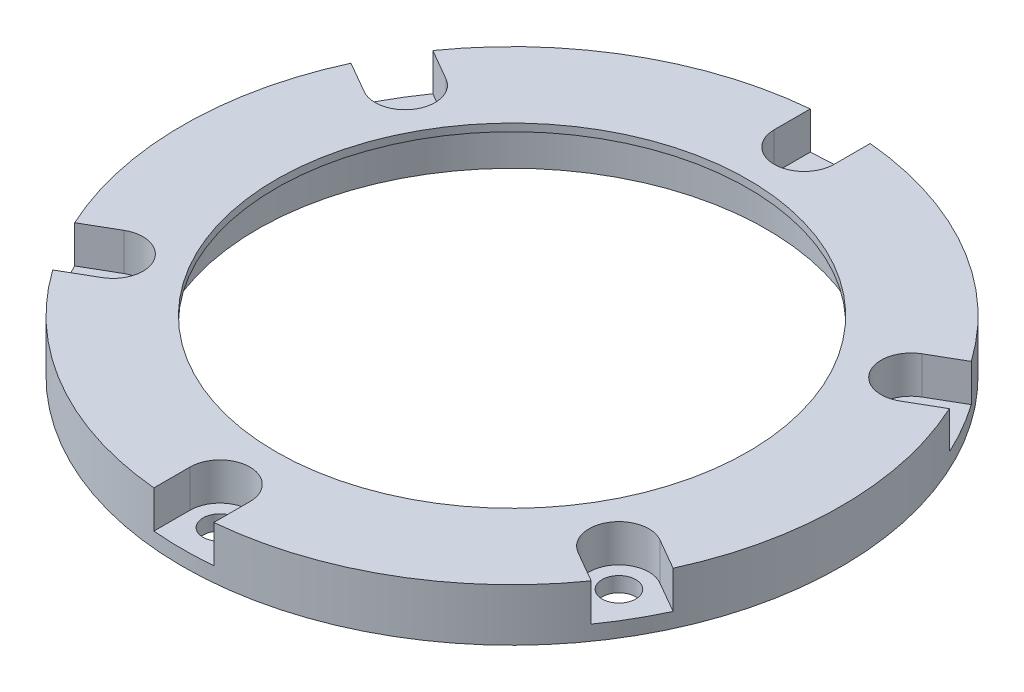
ISO-10303-21;
HEADER;
FILE_DESCRIPTION(('STEP AP214'),'2;1');
FILE_NAME('part.step','',(''),(''),'','','');
FILE_SCHEMA(('AUTOMOTIVE_DESIGN { 1 0 10303 214 1 1 1 1 }'));
ENDSEC;
DATA;
#1=APPLICATION_CONTEXT('core data for automotive mechanical design processes');
#2=APPLICATION_PROTOCOL_DEFINITION('international standard','automotive_design',2000,#1);
#3=PRODUCT_CONTEXT('',#1,'mechanical');
#4=PRODUCT('Part','Part','',(#3));
#5=PRODUCT_RELATED_PRODUCT_CATEGORY('part','',(#4));
#6=PRODUCT_DEFINITION_FORMATION('','',#4);
#7=PRODUCT_DEFINITION_CONTEXT('part definition',#1,'design');
#8=PRODUCT_DEFINITION('design','',#6,#7);
#9=PRODUCT_DEFINITION_SHAPE('','',#8);
#10=(LENGTH_UNIT() NAMED_UNIT(*) SI_UNIT(.MILLI.,.METRE.));
#11=(NAMED_UNIT(*) PLANE_ANGLE_UNIT() SI_UNIT($,.RADIAN.));
#12=(NAMED_UNIT(*) SI_UNIT($,.STERADIAN.) SOLID_ANGLE_UNIT());
#13=UNCERTAINTY_MEASURE_WITH_UNIT(LENGTH_MEASURE(1.E-05),#10,'distance_accuracy_value','');
#14=(GEOMETRIC_REPRESENTATION_CONTEXT(3) GLOBAL_UNCERTAINTY_ASSIGNED_CONTEXT((#13)) GLOBAL_UNIT_ASSIGNED_CONTEXT((#10,
#11,#12)) REPRESENTATION_CONTEXT('',''));
#15=CARTESIAN_POINT('',(0.,0.,0.));
#16=DIRECTION('',(0.,0.,1.));
#17=DIRECTION('',(1.,0.,0.));
#18=AXIS2_PLACEMENT_3D('',#15,#16,#17);
#19=CARTESIAN_POINT('',(-33.7749907475932,7.,-19.4999999999999));
#20=DIRECTION('',(0.,1.,0.));
#21=DIRECTION('',(0.,0.,1.));
#22=AXIS2_PLACEMENT_3D('',#19,#20,#21);
#23=CYLINDRICAL_SURFACE('',#22,4.);
#24=DIRECTION('',(0.,1.,0.));
#25=VECTOR('',#24,1.);
#26=CARTESIAN_POINT('',(-35.7749907475931,2.,-16.0358983848622));
#27=LINE('',#26,#25);
#28=CARTESIAN_POINT('',(-35.7749907475931,2.,-16.0358983848622));
#29=VERTEX_POINT('',#28);
#30=CARTESIAN_POINT('',(-35.7749907475931,7.,-16.0358983848622));
#31=VERTEX_POINT('',#30);
#32=EDGE_CURVE('E50',#29,#31,#27,.T.);
#33=ORIENTED_EDGE('',*,*,#32,.T.);
#34=CARTESIAN_POINT('',(-33.7749907475932,7.,-19.4999999999999));
#35=DIRECTION('',(0.,1.,0.));
#36=DIRECTION('',(0.,0.,1.));
#37=AXIS2_PLACEMENT_3D('',#34,#35,#36);
#38=CIRCLE('',#37,4.);
#39=CARTESIAN_POINT('',(-31.7749907475932,7.,-22.9641016151377));
#40=VERTEX_POINT('',#39);
#41=EDGE_CURVE('E230',#31,#40,#38,.T.);
#42=ORIENTED_EDGE('',*,*,#41,.T.);
#43=DIRECTION('',(0.,1.,0.));
#44=VECTOR('',#43,1.);
#45=CARTESIAN_POINT('',(-31.7749907475932,2.,-22.9641016151377));
#46=LINE('',#45,#44);
#47=CARTESIAN_POINT('',(-31.7749907475932,2.,-22.9641016151377));
#48=VERTEX_POINT('',#47);
#49=EDGE_CURVE('E503',#48,#40,#46,.T.);
#50=ORIENTED_EDGE('',*,*,#49,.F.);
#51=CARTESIAN_POINT('',(-33.7749907475932,2.,-19.4999999999999));
#52=DIRECTION('',(0.,1.,0.));
#53=DIRECTION('',(0.,0.,1.));
#54=AXIS2_PLACEMENT_3D('',#51,#52,#53);
#55=CIRCLE('',#54,4.);
#56=EDGE_CURVE('E233',#29,#48,#55,.T.);
#57=ORIENTED_EDGE('',*,*,#56,.F.);
#58=EDGE_LOOP('',(#33,#42,#50,#57));
#59=FACE_BOUND('',#58,.T.);
#60=ADVANCED_FACE('F35',(#59),#23,.F.);
#61=CARTESIAN_POINT('',(-33.774990747593,7.,19.5000000000002));
#62=DIRECTION('',(0.,1.,0.));
#63=DIRECTION('',(0.,0.,1.));
#64=AXIS2_PLACEMENT_3D('',#61,#62,#63);
#65=CYLINDRICAL_SURFACE('',#64,4.);
#66=DIRECTION('',(0.,1.,0.));
#67=VECTOR('',#66,1.);
#68=CARTESIAN_POINT('',(-31.774990747593,2.,22.9641016151379));
#69=LINE('',#68,#67);
#70=CARTESIAN_POINT('',(-31.774990747593,2.,22.9641016151379));
#71=VERTEX_POINT('',#70);
#72=CARTESIAN_POINT('',(-31.774990747593,7.,22.9641016151379));
#73=VERTEX_POINT('',#72);
#74=EDGE_CURVE('E58',#71,#73,#69,.T.);
#75=ORIENTED_EDGE('',*,*,#74,.T.);
#76=CARTESIAN_POINT('',(-33.774990747593,7.,19.5000000000002));
#77=DIRECTION('',(0.,1.,0.));
#78=DIRECTION('',(0.,0.,1.));
#79=AXIS2_PLACEMENT_3D('',#76,#77,#78);
#80=CIRCLE('',#79,4.);
#81=CARTESIAN_POINT('',(-35.774990747593,7.,16.0358983848624));
#82=VERTEX_POINT('',#81);
#83=EDGE_CURVE('E216',#73,#82,#80,.T.);
#84=ORIENTED_EDGE('',*,*,#83,.T.);
#85=DIRECTION('',(0.,1.,0.));
#86=VECTOR('',#85,1.);
#87=CARTESIAN_POINT('',(-35.774990747593,2.,16.0358983848624));
#88=LINE('',#87,#86);
#89=CARTESIAN_POINT('',(-35.774990747593,2.,16.0358983848624));
#90=VERTEX_POINT('',#89);
#91=EDGE_CURVE('E200',#90,#82,#88,.T.);
#92=ORIENTED_EDGE('',*,*,#91,.F.);
#93=CARTESIAN_POINT('',(-33.774990747593,2.,19.5000000000002));
#94=DIRECTION('',(0.,1.,0.));
#95=DIRECTION('',(0.,0.,1.));
#96=AXIS2_PLACEMENT_3D('',#93,#94,#95);
#97=CIRCLE('',#96,4.);
#98=EDGE_CURVE('E214',#71,#90,#97,.T.);
#99=ORIENTED_EDGE('',*,*,#98,.F.);
#100=EDGE_LOOP('',(#75,#84,#92,#99));
#101=FACE_BOUND('',#100,.T.);
#102=ADVANCED_FACE('F213',(#101),#65,.F.);
#103=CARTESIAN_POINT('',(0.,7.,39.));
#104=DIRECTION('',(0.,1.,0.));
#105=DIRECTION('',(0.,0.,1.));
#106=AXIS2_PLACEMENT_3D('',#103,#104,#105);
#107=CYLINDRICAL_SURFACE('',#106,4.);
#108=DIRECTION('',(0.,1.,0.));
#109=VECTOR('',#108,1.);
#110=CARTESIAN_POINT('',(4.,2.,39.));
#111=LINE('',#110,#109);
#112=CARTESIAN_POINT('',(4.,2.,39.));
#113=VERTEX_POINT('',#112);
#114=CARTESIAN_POINT('',(4.,7.,39.));
#115=VERTEX_POINT('',#114);
#116=EDGE_CURVE('E208',#113,#115,#111,.T.);
#117=ORIENTED_EDGE('',*,*,#116,.T.);
#118=CARTESIAN_POINT('',(0.,7.,39.));
#119=DIRECTION('',(0.,1.,0.));
#120=DIRECTION('',(0.,0.,1.));
#121=AXIS2_PLACEMENT_3D('',#118,#119,#120);
#122=CIRCLE('',#121,4.);
#123=CARTESIAN_POINT('',(-4.,7.,39.));
#124=VERTEX_POINT('',#123);
#125=EDGE_CURVE('E437',#115,#124,#122,.T.);
#126=ORIENTED_EDGE('',*,*,#125,.T.);
#127=DIRECTION('',(0.,1.,0.));
#128=VECTOR('',#127,1.);
#129=CARTESIAN_POINT('',(-4.,2.,39.));
#130=LINE('',#129,#128);
#131=CARTESIAN_POINT('',(-4.,2.,39.));
#132=VERTEX_POINT('',#131);
#133=EDGE_CURVE('E471',#132,#124,#130,.T.);
#134=ORIENTED_EDGE('',*,*,#133,.F.);
#135=CARTESIAN_POINT('',(0.,2.,39.));
#136=DIRECTION('',(0.,1.,0.));
#137=DIRECTION('',(0.,0.,1.));
#138=AXIS2_PLACEMENT_3D('',#135,#136,#137);
#139=CIRCLE('',#138,4.);
#140=EDGE_CURVE('E440',#113,#132,#139,.T.);
#141=ORIENTED_EDGE('',*,*,#140,.F.);
#142=EDGE_LOOP('',(#117,#126,#134,#141));
#143=FACE_BOUND('',#142,.T.);
#144=ADVANCED_FACE('F291',(#143),#107,.F.);
#145=CARTESIAN_POINT('',(33.7749907475933,7.,19.4999999999997));
#146=DIRECTION('',(0.,1.,0.));
#147=DIRECTION('',(0.,0.,1.));
#148=AXIS2_PLACEMENT_3D('',#145,#146,#147);
#149=CYLINDRICAL_SURFACE('',#148,4.);
#150=DIRECTION('',(0.,1.,0.));
#151=VECTOR('',#150,1.);
#152=CARTESIAN_POINT('',(35.7749907475933,2.,16.0358983848619));
#153=LINE('',#152,#151);
#154=CARTESIAN_POINT('',(35.7749907475933,2.,16.0358983848619));
#155=VERTEX_POINT('',#154);
#156=CARTESIAN_POINT('',(35.7749907475933,7.,16.0358983848619));
#157=VERTEX_POINT('',#156);
#158=EDGE_CURVE('E485',#155,#157,#153,.T.);
#159=ORIENTED_EDGE('',*,*,#158,.T.);
#160=CARTESIAN_POINT('',(33.7749907475933,7.,19.4999999999997));
#161=DIRECTION('',(0.,1.,0.));
#162=DIRECTION('',(0.,0.,1.));
#163=AXIS2_PLACEMENT_3D('',#160,#161,#162);
#164=CIRCLE('',#163,4.);
#165=CARTESIAN_POINT('',(31.7749907475933,7.,22.9641016151375));
#166=VERTEX_POINT('',#165);
#167=EDGE_CURVE('E425',#157,#166,#164,.T.);
#168=ORIENTED_EDGE('',*,*,#167,.T.);
#169=DIRECTION('',(0.,1.,0.));
#170=VECTOR('',#169,1.);
#171=CARTESIAN_POINT('',(31.7749907475933,2.,22.9641016151375));
#172=LINE('',#171,#170);
#173=CARTESIAN_POINT('',(31.7749907475933,2.,22.9641016151375));
#174=VERTEX_POINT('',#173);
#175=EDGE_CURVE('E484',#174,#166,#172,.T.);
#176=ORIENTED_EDGE('',*,*,#175,.F.);
#177=CARTESIAN_POINT('',(33.7749907475933,2.,19.4999999999997));
#178=DIRECTION('',(0.,1.,0.));
#179=DIRECTION('',(0.,0.,1.));
#180=AXIS2_PLACEMENT_3D('',#177,#178,#179);
#181=CIRCLE('',#180,4.);
#182=EDGE_CURVE('E428',#155,#174,#181,.T.);
#183=ORIENTED_EDGE('',*,*,#182,.F.);
#184=EDGE_LOOP('',(#159,#168,#176,#183));
#185=FACE_BOUND('',#184,.T.);
#186=ADVANCED_FACE('F550',(#185),#149,.F.);
#187=CARTESIAN_POINT('',(33.7749907475929,7.,-19.5000000000004));
#188=DIRECTION('',(0.,1.,0.));
#189=DIRECTION('',(0.,0.,1.));
#190=AXIS2_PLACEMENT_3D('',#187,#188,#189);
#191=CYLINDRICAL_SURFACE('',#190,4.);
#192=DIRECTION('',(0.,1.,0.));
#193=VECTOR('',#192,1.);
#194=CARTESIAN_POINT('',(31.7749907475928,2.,-22.9641016151381));
#195=LINE('',#194,#193);
#196=CARTESIAN_POINT('',(31.7749907475928,2.,-22.9641016151381));
#197=VERTEX_POINT('',#196);
#198=CARTESIAN_POINT('',(31.7749907475928,7.,-22.9641016151381));
#199=VERTEX_POINT('',#198);
#200=EDGE_CURVE('E481',#197,#199,#195,.T.);
#201=ORIENTED_EDGE('',*,*,#200,.T.);
#202=CARTESIAN_POINT('',(33.7749907475929,7.,-19.5000000000004));
#203=DIRECTION('',(0.,1.,0.));
#204=DIRECTION('',(0.,0.,1.));
#205=AXIS2_PLACEMENT_3D('',#202,#203,#204);
#206=CIRCLE('',#205,4.);
#207=CARTESIAN_POINT('',(35.7749907475929,7.,-16.0358983848627));
#208=VERTEX_POINT('',#207);
#209=EDGE_CURVE('E340',#199,#208,#206,.T.);
#210=ORIENTED_EDGE('',*,*,#209,.T.);
#211=DIRECTION('',(0.,1.,0.));
#212=VECTOR('',#211,1.);
#213=CARTESIAN_POINT('',(35.7749907475929,2.,-16.0358983848627));
#214=LINE('',#213,#212);
#215=CARTESIAN_POINT('',(35.7749907475929,2.,-16.0358983848627));
#216=VERTEX_POINT('',#215);
#217=EDGE_CURVE('E495',#216,#208,#214,.T.);
#218=ORIENTED_EDGE('',*,*,#217,.F.);
#219=CARTESIAN_POINT('',(33.7749907475929,2.,-19.5000000000004));
#220=DIRECTION('',(0.,1.,0.));
#221=DIRECTION('',(0.,0.,1.));
#222=AXIS2_PLACEMENT_3D('',#219,#220,#221);
#223=CIRCLE('',#222,4.);
#224=EDGE_CURVE('E416',#197,#216,#223,.T.);
#225=ORIENTED_EDGE('',*,*,#224,.F.);
#226=EDGE_LOOP('',(#201,#210,#218,#225));
#227=FACE_BOUND('',#226,.T.);
#228=ADVANCED_FACE('F309',(#227),#191,.F.);
#229=CARTESIAN_POINT('',(0.,7.,-39.));
#230=DIRECTION('',(0.,1.,0.));
#231=DIRECTION('',(0.,0.,1.));
#232=AXIS2_PLACEMENT_3D('',#229,#230,#231);
#233=CYLINDRICAL_SURFACE('',#232,4.);
#234=DIRECTION('',(0.,1.,0.));
#235=VECTOR('',#234,1.);
#236=CARTESIAN_POINT('',(-4.,2.,-39.));
#237=LINE('',#236,#235);
#238=CARTESIAN_POINT('',(-4.,2.,-39.));
#239=VERTEX_POINT('',#238);
#240=CARTESIAN_POINT('',(-4.,7.,-39.));
#241=VERTEX_POINT('',#240);
#242=EDGE_CURVE('E401',#239,#241,#237,.T.);
#243=ORIENTED_EDGE('',*,*,#242,.T.);
#244=CARTESIAN_POINT('',(0.,7.,-39.));
#245=DIRECTION('',(0.,1.,0.));
#246=DIRECTION('',(0.,0.,1.));
#247=AXIS2_PLACEMENT_3D('',#244,#245,#246);
#248=CIRCLE('',#247,4.);
#249=CARTESIAN_POINT('',(4.,7.,-39.));
#250=VERTEX_POINT('',#249);
#251=EDGE_CURVE('E242',#241,#250,#248,.T.);
#252=ORIENTED_EDGE('',*,*,#251,.T.);
#253=DIRECTION('',(0.,1.,0.));
#254=VECTOR('',#253,1.);
#255=CARTESIAN_POINT('',(4.,2.,-39.));
#256=LINE('',#255,#254);
#257=CARTESIAN_POINT('',(4.,2.,-39.));
#258=VERTEX_POINT('',#257);
#259=EDGE_CURVE('E400',#258,#250,#256,.T.);
#260=ORIENTED_EDGE('',*,*,#259,.F.);
#261=CARTESIAN_POINT('',(0.,2.,-39.));
#262=DIRECTION('',(0.,1.,0.));
#263=DIRECTION('',(0.,0.,1.));
#264=AXIS2_PLACEMENT_3D('',#261,#262,#263);
#265=CIRCLE('',#264,4.);
#266=EDGE_CURVE('E245',#239,#258,#265,.T.);
#267=ORIENTED_EDGE('',*,*,#266,.F.);
#268=EDGE_LOOP('',(#243,#252,#260,#267));
#269=FACE_BOUND('',#268,.T.);
#270=ADVANCED_FACE('F306',(#269),#233,.F.);
#271=CARTESIAN_POINT('',(0.,0.,0.));
#272=DIRECTION('',(0.,1.,0.));
#273=DIRECTION('',(0.,0.,1.));
#274=AXIS2_PLACEMENT_3D('',#271,#272,#273);
#275=PLANE('',#274);
#276=CARTESIAN_POINT('',(33.7749907475929,0.,-19.5000000000004));
#277=DIRECTION('',(0.,1.,0.));
#278=DIRECTION('',(0.,0.,1.));
#279=AXIS2_PLACEMENT_3D('',#276,#277,#278);
#280=CIRCLE('',#279,2.25);
#281=CARTESIAN_POINT('',(33.7749907475929,0.,-17.2500000000004));
#282=VERTEX_POINT('',#281);
#283=EDGE_CURVE('E422',#282,#282,#280,.T.);
#284=ORIENTED_EDGE('',*,*,#283,.T.);
#285=EDGE_LOOP('',(#284));
#286=FACE_BOUND('',#285,.T.);
#287=CARTESIAN_POINT('',(33.7749907475933,0.,19.4999999999997));
#288=DIRECTION('',(0.,1.,0.));
#289=DIRECTION('',(0.,0.,1.));
#290=AXIS2_PLACEMENT_3D('',#287,#288,#289);
#291=CIRCLE('',#290,2.25);
#292=CARTESIAN_POINT('',(33.7749907475933,0.,21.7499999999997));
#293=VERTEX_POINT('',#292);
#294=EDGE_CURVE('E434',#293,#293,#291,.T.);
#295=ORIENTED_EDGE('',*,*,#294,.T.);
#296=EDGE_LOOP('',(#295));
#297=FACE_BOUND('',#296,.T.);
#298=CARTESIAN_POINT('',(0.,0.,39.));
#299=DIRECTION('',(0.,1.,0.));
#300=DIRECTION('',(0.,0.,1.));
#301=AXIS2_PLACEMENT_3D('',#298,#299,#300);
#302=CIRCLE('',#301,2.25);
#303=CARTESIAN_POINT('',(0.,0.,41.25));
#304=VERTEX_POINT('',#303);
#305=EDGE_CURVE('E224',#304,#304,#302,.T.);
#306=ORIENTED_EDGE('',*,*,#305,.T.);
#307=EDGE_LOOP('',(#306));
#308=FACE_BOUND('',#307,.T.);
#309=CARTESIAN_POINT('',(-33.774990747593,0.,19.5000000000002));
#310=DIRECTION('',(0.,1.,0.));
#311=DIRECTION('',(0.,0.,1.));
#312=AXIS2_PLACEMENT_3D('',#309,#310,#311);
#313=CIRCLE('',#312,2.25);
#314=CARTESIAN_POINT('',(-33.774990747593,0.,21.7500000000002));
#315=VERTEX_POINT('',#314);
#316=EDGE_CURVE('E222',#315,#315,#313,.T.);
#317=ORIENTED_EDGE('',*,*,#316,.T.);
#318=EDGE_LOOP('',(#317));
#319=FACE_BOUND('',#318,.T.);
#320=CARTESIAN_POINT('',(-33.7749907475932,0.,-19.4999999999999));
#321=DIRECTION('',(0.,1.,0.));
#322=DIRECTION('',(0.,0.,1.));
#323=AXIS2_PLACEMENT_3D('',#320,#321,#322);
#324=CIRCLE('',#323,2.25);
#325=CARTESIAN_POINT('',(-33.7749907475932,0.,-17.2499999999999));
#326=VERTEX_POINT('',#325);
#327=EDGE_CURVE('E239',#326,#326,#324,.T.);
#328=ORIENTED_EDGE('',*,*,#327,.T.);
#329=EDGE_LOOP('',(#328));
#330=FACE_BOUND('',#329,.T.);
#331=CARTESIAN_POINT('',(0.,0.,-39.));
#332=DIRECTION('',(0.,1.,0.));
#333=DIRECTION('',(0.,0.,1.));
#334=AXIS2_PLACEMENT_3D('',#331,#332,#333);
#335=CIRCLE('',#334,2.25);
#336=CARTESIAN_POINT('',(0.,0.,-36.75));
#337=VERTEX_POINT('',#336);
#338=EDGE_CURVE('E251',#337,#337,#335,.T.);
#339=ORIENTED_EDGE('',*,*,#338,.T.);
#340=EDGE_LOOP('',(#339));
#341=FACE_BOUND('',#340,.T.);
#342=CARTESIAN_POINT('',(0.,0.,0.));
#343=DIRECTION('',(0.,1.,0.));
#344=DIRECTION('',(0.,0.,1.));
#345=AXIS2_PLACEMENT_3D('',#342,#343,#344);
#346=CIRCLE('',#345,44.);
#347=CARTESIAN_POINT('',(0.,0.,44.));
#348=VERTEX_POINT('',#347);
#349=EDGE_CURVE('E11',#348,#348,#346,.T.);
#350=ORIENTED_EDGE('',*,*,#349,.F.);
#351=EDGE_LOOP('',(#350));
#352=FACE_BOUND('',#351,.T.);
#353=CARTESIAN_POINT('',(0.,0.,0.));
#354=DIRECTION('',(0.,1.,0.));
#355=DIRECTION('',(0.,0.,1.));
#356=AXIS2_PLACEMENT_3D('',#353,#354,#355);
#357=CIRCLE('',#356,34.);
#358=CARTESIAN_POINT('',(0.,0.,34.));
#359=VERTEX_POINT('',#358);
#360=EDGE_CURVE('E43',#359,#359,#357,.T.);
#361=ORIENTED_EDGE('',*,*,#360,.T.);
#362=EDGE_LOOP('',(#361));
#363=FACE_BOUND('',#362,.T.);
#364=ADVANCED_FACE('F270',(#286,#297,#308,#319,#330,#341,#352,#363),#275,.F.);
#365=CARTESIAN_POINT('',(0.,6.,0.));
#366=DIRECTION('',(0.,-1.,0.));
#367=DIRECTION('',(0.,0.,-1.));
#368=AXIS2_PLACEMENT_3D('',#365,#366,#367);
#369=CYLINDRICAL_SURFACE('',#368,44.);
#370=CARTESIAN_POINT('',(0.,7.,0.));
#371=DIRECTION('',(0.,1.,0.));
#372=DIRECTION('',(0.,0.,1.));
#373=AXIS2_PLACEMENT_3D('',#370,#371,#372);
#374=CIRCLE('',#373,44.);
#375=CARTESIAN_POINT('',(35.9473319220203,7.,-25.3730039153448));
#376=VERTEX_POINT('',#375);
#377=CARTESIAN_POINT('',(4.,7.,-43.8178046004133));
#378=VERTEX_POINT('',#377);
#379=EDGE_CURVE('E258',#376,#378,#374,.T.);
#380=ORIENTED_EDGE('',*,*,#379,.F.);
#381=DIRECTION('',(0.,-1.,0.));
#382=VECTOR('',#381,1.);
#383=CARTESIAN_POINT('',(35.9473319220203,6.,-25.3730039153448));
#384=LINE('',#383,#382);
#385=CARTESIAN_POINT('',(35.9473319220203,2.,-25.3730039153448));
#386=VERTEX_POINT('',#385);
#387=EDGE_CURVE('E343',#376,#386,#384,.T.);
#388=ORIENTED_EDGE('',*,*,#387,.T.);
#389=CARTESIAN_POINT('',(0.,2.,0.));
#390=DIRECTION('',(0.,1.,0.));
#391=DIRECTION('',(0.,0.,1.));
#392=AXIS2_PLACEMENT_3D('',#389,#390,#391);
#393=CIRCLE('',#392,44.);
#394=CARTESIAN_POINT('',(39.9473319220203,2.,-18.4448006850694));
#395=VERTEX_POINT('',#394);
#396=EDGE_CURVE('E505',#395,#386,#393,.T.);
#397=ORIENTED_EDGE('',*,*,#396,.F.);
#398=DIRECTION('',(0.,-1.,0.));
#399=VECTOR('',#398,1.);
#400=CARTESIAN_POINT('',(39.9473319220203,6.,-18.4448006850694));
#401=LINE('',#400,#399);
#402=CARTESIAN_POINT('',(39.9473319220203,7.,-18.4448006850694));
#403=VERTEX_POINT('',#402);
#404=EDGE_CURVE('E344',#395,#403,#401,.F.);
#405=ORIENTED_EDGE('',*,*,#404,.T.);
#406=CARTESIAN_POINT('',(39.9473319220207,7.,18.4448006850685));
#407=VERTEX_POINT('',#406);
#408=EDGE_CURVE('E352',#407,#403,#374,.T.);
#409=ORIENTED_EDGE('',*,*,#408,.F.);
#410=DIRECTION('',(0.,-1.,0.));
#411=VECTOR('',#410,1.);
#412=CARTESIAN_POINT('',(39.9473319220207,6.,18.4448006850685));
#413=LINE('',#412,#411);
#414=CARTESIAN_POINT('',(39.9473319220207,2.,18.4448006850685));
#415=VERTEX_POINT('',#414);
#416=EDGE_CURVE('E522',#407,#415,#413,.T.);
#417=ORIENTED_EDGE('',*,*,#416,.T.);
#418=CARTESIAN_POINT('',(0.,2.,0.));
#419=DIRECTION('',(0.,1.,0.));
#420=DIRECTION('',(0.,0.,1.));
#421=AXIS2_PLACEMENT_3D('',#418,#419,#420);
#422=CIRCLE('',#421,44.);
#423=CARTESIAN_POINT('',(35.9473319220208,2.,25.3730039153441));
#424=VERTEX_POINT('',#423);
#425=EDGE_CURVE('E513',#424,#415,#422,.T.);
#426=ORIENTED_EDGE('',*,*,#425,.F.);
#427=DIRECTION('',(0.,-1.,0.));
#428=VECTOR('',#427,1.);
#429=CARTESIAN_POINT('',(35.9473319220208,6.,25.3730039153441));
#430=LINE('',#429,#428);
#431=CARTESIAN_POINT('',(35.9473319220208,7.,25.3730039153441));
#432=VERTEX_POINT('',#431);
#433=EDGE_CURVE('E517',#424,#432,#430,.F.);
#434=ORIENTED_EDGE('',*,*,#433,.T.);
#435=CARTESIAN_POINT('',(4.,7.,43.8178046004133));
#436=VERTEX_POINT('',#435);
#437=EDGE_CURVE('E354',#436,#432,#374,.T.);
#438=ORIENTED_EDGE('',*,*,#437,.F.);
#439=DIRECTION('',(0.,-1.,0.));
#440=VECTOR('',#439,1.);
#441=CARTESIAN_POINT('',(4.,6.,43.8178046004133));
#442=LINE('',#441,#440);
#443=CARTESIAN_POINT('',(4.,2.,43.8178046004133));
#444=VERTEX_POINT('',#443);
#445=EDGE_CURVE('E534',#436,#444,#442,.T.);
#446=ORIENTED_EDGE('',*,*,#445,.T.);
#447=CARTESIAN_POINT('',(0.,2.,0.));
#448=DIRECTION('',(0.,1.,0.));
#449=DIRECTION('',(0.,0.,1.));
#450=AXIS2_PLACEMENT_3D('',#447,#448,#449);
#451=CIRCLE('',#450,44.);
#452=CARTESIAN_POINT('',(-4.,2.,43.8178046004133));
#453=VERTEX_POINT('',#452);
#454=EDGE_CURVE('E525',#453,#444,#451,.T.);
#455=ORIENTED_EDGE('',*,*,#454,.F.);
#456=DIRECTION('',(0.,-1.,0.));
#457=VECTOR('',#456,1.);
#458=CARTESIAN_POINT('',(-4.,6.,43.8178046004133));
#459=LINE('',#458,#457);
#460=CARTESIAN_POINT('',(-4.,7.,43.8178046004133));
#461=VERTEX_POINT('',#460);
#462=EDGE_CURVE('E529',#453,#461,#459,.F.);
#463=ORIENTED_EDGE('',*,*,#462,.T.);
#464=CARTESIAN_POINT('',(-35.9473319220205,7.,25.3730039153446));
#465=VERTEX_POINT('',#464);
#466=EDGE_CURVE('E358',#465,#461,#374,.T.);
#467=ORIENTED_EDGE('',*,*,#466,.F.);
#468=DIRECTION('',(0.,-1.,0.));
#469=VECTOR('',#468,1.);
#470=CARTESIAN_POINT('',(-35.9473319220205,6.,25.3730039153446));
#471=LINE('',#470,#469);
#472=CARTESIAN_POINT('',(-35.9473319220205,2.,25.3730039153446));
#473=VERTEX_POINT('',#472);
#474=EDGE_CURVE('E379',#465,#473,#471,.T.);
#475=ORIENTED_EDGE('',*,*,#474,.T.);
#476=CARTESIAN_POINT('',(0.,2.,0.));
#477=DIRECTION('',(0.,1.,0.));
#478=DIRECTION('',(0.,0.,1.));
#479=AXIS2_PLACEMENT_3D('',#476,#477,#478);
#480=CIRCLE('',#479,44.);
#481=CARTESIAN_POINT('',(-39.9473319220205,2.,18.4448006850691));
#482=VERTEX_POINT('',#481);
#483=EDGE_CURVE('E376',#482,#473,#480,.T.);
#484=ORIENTED_EDGE('',*,*,#483,.F.);
#485=DIRECTION('',(0.,-1.,0.));
#486=VECTOR('',#485,1.);
#487=CARTESIAN_POINT('',(-39.9473319220205,6.,18.4448006850691));
#488=LINE('',#487,#486);
#489=CARTESIAN_POINT('',(-39.9473319220205,7.,18.4448006850691));
#490=VERTEX_POINT('',#489);
#491=EDGE_CURVE('E203',#482,#490,#488,.F.);
#492=ORIENTED_EDGE('',*,*,#491,.T.);
#493=CARTESIAN_POINT('',(-39.9473319220206,7.,-18.4448006850688));
#494=VERTEX_POINT('',#493);
#495=EDGE_CURVE('E265',#494,#490,#374,.T.);
#496=ORIENTED_EDGE('',*,*,#495,.F.);
#497=DIRECTION('',(0.,-1.,0.));
#498=VECTOR('',#497,1.);
#499=CARTESIAN_POINT('',(-39.9473319220206,6.,-18.4448006850688));
#500=LINE('',#499,#498);
#501=CARTESIAN_POINT('',(-39.9473319220206,2.,-18.4448006850688));
#502=VERTEX_POINT('',#501);
#503=EDGE_CURVE('E374',#494,#502,#500,.T.);
#504=ORIENTED_EDGE('',*,*,#503,.T.);
#505=CARTESIAN_POINT('',(0.,2.,0.));
#506=DIRECTION('',(0.,1.,0.));
#507=DIRECTION('',(0.,0.,1.));
#508=AXIS2_PLACEMENT_3D('',#505,#506,#507);
#509=CIRCLE('',#508,44.);
#510=CARTESIAN_POINT('',(-35.9473319220206,2.,-25.3730039153443));
#511=VERTEX_POINT('',#510);
#512=EDGE_CURVE('E385',#511,#502,#509,.T.);
#513=ORIENTED_EDGE('',*,*,#512,.F.);
#514=DIRECTION('',(0.,-1.,0.));
#515=VECTOR('',#514,1.);
#516=CARTESIAN_POINT('',(-35.9473319220206,6.,-25.3730039153443));
#517=LINE('',#516,#515);
#518=CARTESIAN_POINT('',(-35.9473319220206,7.,-25.3730039153443));
#519=VERTEX_POINT('',#518);
#520=EDGE_CURVE('E389',#511,#519,#517,.F.);
#521=ORIENTED_EDGE('',*,*,#520,.T.);
#522=CARTESIAN_POINT('',(-4.,7.,-43.8178046004133));
#523=VERTEX_POINT('',#522);
#524=EDGE_CURVE('E261',#523,#519,#374,.T.);
#525=ORIENTED_EDGE('',*,*,#524,.F.);
#526=DIRECTION('',(0.,-1.,0.));
#527=VECTOR('',#526,1.);
#528=CARTESIAN_POINT('',(-4.,6.,-43.8178046004133));
#529=LINE('',#528,#527);
#530=CARTESIAN_POINT('',(-4.,2.,-43.8178046004133));
#531=VERTEX_POINT('',#530);
#532=EDGE_CURVE('E412',#523,#531,#529,.T.);
#533=ORIENTED_EDGE('',*,*,#532,.T.);
#534=CARTESIAN_POINT('',(0.,2.,0.));
#535=DIRECTION('',(0.,1.,0.));
#536=DIRECTION('',(0.,0.,1.));
#537=AXIS2_PLACEMENT_3D('',#534,#535,#536);
#538=CIRCLE('',#537,44.);
#539=CARTESIAN_POINT('',(4.,2.,-43.8178046004133));
#540=VERTEX_POINT('',#539);
#541=EDGE_CURVE('E404',#540,#531,#538,.T.);
#542=ORIENTED_EDGE('',*,*,#541,.F.);
#543=DIRECTION('',(0.,-1.,0.));
#544=VECTOR('',#543,1.);
#545=CARTESIAN_POINT('',(4.,6.,-43.8178046004133));
#546=LINE('',#545,#544);
#547=EDGE_CURVE('E351',#540,#378,#546,.F.);
#548=ORIENTED_EDGE('',*,*,#547,.T.);
#549=EDGE_LOOP('',(#380,#388,#397,#405,#409,#417,#426,#434,#438,#446,#455,#463,#467,#475,#484,
#492,#496,#504,#513,#521,#525,#533,#542,#548));
#550=FACE_BOUND('',#549,.T.);
#551=ORIENTED_EDGE('',*,*,#349,.T.);
#552=EDGE_LOOP('',(#551));
#553=FACE_BOUND('',#552,.T.);
#554=ADVANCED_FACE('F37',(#550,#553),#369,.T.);
#555=CARTESIAN_POINT('',(0.,6.,0.));
#556=DIRECTION('',(0.,-1.,0.));
#557=DIRECTION('',(0.,0.,-1.));
#558=AXIS2_PLACEMENT_3D('',#555,#556,#557);
#559=CYLINDRICAL_SURFACE('',#558,34.);
#560=CARTESIAN_POINT('',(0.,6.,0.));
#561=DIRECTION('',(0.,1.,0.));
#562=DIRECTION('',(0.,0.,1.));
#563=AXIS2_PLACEMENT_3D('',#560,#561,#562);
#564=CIRCLE('',#563,34.);
#565=CARTESIAN_POINT('',(0.,6.,34.));
#566=VERTEX_POINT('',#565);
#567=EDGE_CURVE('E264',#566,#566,#564,.T.);
#568=ORIENTED_EDGE('',*,*,#567,.T.);
#569=EDGE_LOOP('',(#568));
#570=FACE_BOUND('',#569,.T.);
#571=ORIENTED_EDGE('',*,*,#360,.F.);
#572=EDGE_LOOP('',(#571));
#573=FACE_BOUND('',#572,.T.);
#574=ADVANCED_FACE('F272',(#570,#573),#559,.F.);
#575=CARTESIAN_POINT('',(0.,6.,0.));
#576=DIRECTION('',(0.,1.,0.));
#577=DIRECTION('',(0.,0.,1.));
#578=AXIS2_PLACEMENT_3D('',#575,#576,#577);
#579=PLANE('',#578);
#580=CARTESIAN_POINT('',(0.,6.,0.));
#581=DIRECTION('',(0.,1.,0.));
#582=DIRECTION('',(0.,0.,1.));
#583=AXIS2_PLACEMENT_3D('',#580,#581,#582);
#584=CIRCLE('',#583,31.5);
#585=CARTESIAN_POINT('',(0.,6.,31.5));
#586=VERTEX_POINT('',#585);
#587=EDGE_CURVE('E254',#586,#586,#584,.T.);
#588=ORIENTED_EDGE('',*,*,#587,.T.);
#589=EDGE_LOOP('',(#588));
#590=FACE_BOUND('',#589,.T.);
#591=ORIENTED_EDGE('',*,*,#567,.F.);
#592=EDGE_LOOP('',(#591));
#593=FACE_BOUND('',#592,.T.);
#594=ADVANCED_FACE('F274',(#590,#593),#579,.F.);
#595=CARTESIAN_POINT('',(0.,7.,0.));
#596=DIRECTION('',(0.,1.,0.));
#597=DIRECTION('',(0.,0.,1.));
#598=AXIS2_PLACEMENT_3D('',#595,#596,#597);
#599=PLANE('',#598);
#600=DIRECTION('',(-0.866025403784433,0.,0.50000000000001));
#601=VECTOR('',#600,1.);
#602=CARTESIAN_POINT('',(-2.00000000000004,7.,-3.46410161513773));
#603=LINE('',#602,#601);
#604=EDGE_CURVE('E329',#376,#199,#603,.T.);
#605=ORIENTED_EDGE('',*,*,#604,.F.);
#606=ORIENTED_EDGE('',*,*,#379,.T.);
#607=DIRECTION('',(0.,0.,-1.));
#608=VECTOR('',#607,1.);
#609=CARTESIAN_POINT('',(4.,7.,0.));
#610=LINE('',#609,#608);
#611=EDGE_CURVE('E407',#250,#378,#610,.T.);
#612=ORIENTED_EDGE('',*,*,#611,.F.);
#613=ORIENTED_EDGE('',*,*,#251,.F.);
#614=DIRECTION('',(0.,0.,1.));
#615=VECTOR('',#614,1.);
#616=CARTESIAN_POINT('',(-4.,7.,0.));
#617=LINE('',#616,#615);
#618=EDGE_CURVE('E410',#523,#241,#617,.T.);
#619=ORIENTED_EDGE('',*,*,#618,.F.);
#620=ORIENTED_EDGE('',*,*,#524,.T.);
#621=DIRECTION('',(-0.86602540378444,0.,-0.499999999999998));
#622=VECTOR('',#621,1.);
#623=CARTESIAN_POINT('',(1.99999999999999,7.,-3.46410161513775));
#624=LINE('',#623,#622);
#625=EDGE_CURVE('E387',#40,#519,#624,.T.);
#626=ORIENTED_EDGE('',*,*,#625,.F.);
#627=ORIENTED_EDGE('',*,*,#41,.F.);
#628=DIRECTION('',(0.86602540378444,0.,0.499999999999998));
#629=VECTOR('',#628,1.);
#630=CARTESIAN_POINT('',(-1.99999999999999,7.,3.46410161513775));
#631=LINE('',#630,#629);
#632=EDGE_CURVE('E371',#494,#31,#631,.T.);
#633=ORIENTED_EDGE('',*,*,#632,.F.);
#634=ORIENTED_EDGE('',*,*,#495,.T.);
#635=DIRECTION('',(-0.866025403784436,0.,0.500000000000004));
#636=VECTOR('',#635,1.);
#637=CARTESIAN_POINT('',(-2.00000000000001,7.,-3.46410161513774));
#638=LINE('',#637,#636);
#639=EDGE_CURVE('E369',#82,#490,#638,.T.);
#640=ORIENTED_EDGE('',*,*,#639,.F.);
#641=ORIENTED_EDGE('',*,*,#83,.F.);
#642=DIRECTION('',(0.866025403784436,0.,-0.500000000000004));
#643=VECTOR('',#642,1.);
#644=CARTESIAN_POINT('',(2.00000000000002,7.,3.46410161513775));
#645=LINE('',#644,#643);
#646=EDGE_CURVE('E377',#465,#73,#645,.T.);
#647=ORIENTED_EDGE('',*,*,#646,.F.);
#648=ORIENTED_EDGE('',*,*,#466,.T.);
#649=DIRECTION('',(0.,0.,1.));
#650=VECTOR('',#649,1.);
#651=CARTESIAN_POINT('',(-4.,7.,0.));
#652=LINE('',#651,#650);
#653=EDGE_CURVE('E527',#124,#461,#652,.T.);
#654=ORIENTED_EDGE('',*,*,#653,.F.);
#655=ORIENTED_EDGE('',*,*,#125,.F.);
#656=DIRECTION('',(0.,0.,-1.));
#657=VECTOR('',#656,1.);
#658=CARTESIAN_POINT('',(4.,7.,0.));
#659=LINE('',#658,#657);
#660=EDGE_CURVE('E532',#436,#115,#659,.T.);
#661=ORIENTED_EDGE('',*,*,#660,.F.);
#662=ORIENTED_EDGE('',*,*,#437,.T.);
#663=DIRECTION('',(0.866025403784443,0.,0.499999999999992));
#664=VECTOR('',#663,1.);
#665=CARTESIAN_POINT('',(-1.99999999999997,7.,3.46410161513777));
#666=LINE('',#665,#664);
#667=EDGE_CURVE('E515',#166,#432,#666,.T.);
#668=ORIENTED_EDGE('',*,*,#667,.F.);
#669=ORIENTED_EDGE('',*,*,#167,.F.);
#670=DIRECTION('',(-0.866025403784443,0.,-0.499999999999992));
#671=VECTOR('',#670,1.);
#672=CARTESIAN_POINT('',(1.99999999999996,7.,-3.46410161513776));
#673=LINE('',#672,#671);
#674=EDGE_CURVE('E520',#407,#157,#673,.T.);
#675=ORIENTED_EDGE('',*,*,#674,.F.);
#676=ORIENTED_EDGE('',*,*,#408,.T.);
#677=DIRECTION('',(0.866025403784433,0.,-0.50000000000001));
#678=VECTOR('',#677,1.);
#679=CARTESIAN_POINT('',(2.00000000000003,7.,3.46410161513772));
#680=LINE('',#679,#678);
#681=EDGE_CURVE('E508',#208,#403,#680,.T.);
#682=ORIENTED_EDGE('',*,*,#681,.F.);
#683=ORIENTED_EDGE('',*,*,#209,.F.);
#684=EDGE_LOOP('',(#605,#606,#612,#613,#619,#620,#626,#627,#633,#634,#640,#641,#647,#648,#654,
#655,#661,#662,#668,#669,#675,#676,#682,#683));
#685=FACE_BOUND('',#684,.T.);
#686=CARTESIAN_POINT('',(0.,7.,0.));
#687=DIRECTION('',(0.,1.,0.));
#688=DIRECTION('',(0.,0.,1.));
#689=AXIS2_PLACEMENT_3D('',#686,#687,#688);
#690=CIRCLE('',#689,31.5);
#691=CARTESIAN_POINT('',(0.,7.,31.5));
#692=VERTEX_POINT('',#691);
#693=EDGE_CURVE('E255',#692,#692,#690,.T.);
#694=ORIENTED_EDGE('',*,*,#693,.F.);
#695=EDGE_LOOP('',(#694));
#696=FACE_BOUND('',#695,.T.);
#697=ADVANCED_FACE('F281',(#685,#696),#599,.T.);
#698=CARTESIAN_POINT('',(0.,7.,0.));
#699=DIRECTION('',(0.,-1.,0.));
#700=DIRECTION('',(0.,0.,-1.));
#701=AXIS2_PLACEMENT_3D('',#698,#699,#700);
#702=CYLINDRICAL_SURFACE('',#701,31.5);
#703=ORIENTED_EDGE('',*,*,#693,.T.);
#704=EDGE_LOOP('',(#703));
#705=FACE_BOUND('',#704,.T.);
#706=ORIENTED_EDGE('',*,*,#587,.F.);
#707=EDGE_LOOP('',(#706));
#708=FACE_BOUND('',#707,.T.);
#709=ADVANCED_FACE('F317',(#705,#708),#702,.F.);
#710=CARTESIAN_POINT('',(0.,7.,-39.));
#711=DIRECTION('',(0.,1.,0.));
#712=DIRECTION('',(0.,0.,1.));
#713=AXIS2_PLACEMENT_3D('',#710,#711,#712);
#714=CYLINDRICAL_SURFACE('',#713,2.25);
#715=ORIENTED_EDGE('',*,*,#338,.F.);
#716=EDGE_LOOP('',(#715));
#717=FACE_BOUND('',#716,.T.);
#718=CARTESIAN_POINT('',(0.,2.,-39.));
#719=DIRECTION('',(0.,1.,0.));
#720=DIRECTION('',(0.,0.,1.));
#721=AXIS2_PLACEMENT_3D('',#718,#719,#720);
#722=CIRCLE('',#721,2.25);
#723=CARTESIAN_POINT('',(0.,2.,-36.75));
#724=VERTEX_POINT('',#723);
#725=EDGE_CURVE('E248',#724,#724,#722,.T.);
#726=ORIENTED_EDGE('',*,*,#725,.T.);
#727=EDGE_LOOP('',(#726));
#728=FACE_BOUND('',#727,.T.);
#729=ADVANCED_FACE('F313',(#717,#728),#714,.F.);
#730=CARTESIAN_POINT('',(2.25,2.,-39.));
#731=DIRECTION('',(0.,-1.,0.));
#732=DIRECTION('',(0.,0.,-1.));
#733=AXIS2_PLACEMENT_3D('',#730,#731,#732);
#734=PLANE('',#733);
#735=ORIENTED_EDGE('',*,*,#725,.F.);
#736=EDGE_LOOP('',(#735));
#737=FACE_BOUND('',#736,.T.);
#738=ORIENTED_EDGE('',*,*,#266,.T.);
#739=DIRECTION('',(0.,0.,-1.));
#740=VECTOR('',#739,1.);
#741=CARTESIAN_POINT('',(4.,2.,-39.));
#742=LINE('',#741,#740);
#743=EDGE_CURVE('E394',#258,#540,#742,.T.);
#744=ORIENTED_EDGE('',*,*,#743,.T.);
#745=ORIENTED_EDGE('',*,*,#541,.T.);
#746=DIRECTION('',(0.,0.,1.));
#747=VECTOR('',#746,1.);
#748=CARTESIAN_POINT('',(-4.,2.,-39.));
#749=LINE('',#748,#747);
#750=EDGE_CURVE('E397',#531,#239,#749,.T.);
#751=ORIENTED_EDGE('',*,*,#750,.T.);
#752=EDGE_LOOP('',(#738,#744,#745,#751));
#753=FACE_BOUND('',#752,.T.);
#754=ADVANCED_FACE('F304',(#737,#753),#734,.F.);
#755=CARTESIAN_POINT('',(-33.7749907475932,7.,-19.4999999999999));
#756=DIRECTION('',(0.,1.,0.));
#757=DIRECTION('',(0.,0.,1.));
#758=AXIS2_PLACEMENT_3D('',#755,#756,#757);
#759=CYLINDRICAL_SURFACE('',#758,2.25);
#760=ORIENTED_EDGE('',*,*,#327,.F.);
#761=EDGE_LOOP('',(#760));
#762=FACE_BOUND('',#761,.T.);
#763=CARTESIAN_POINT('',(-33.7749907475932,2.,-19.4999999999999));
#764=DIRECTION('',(0.,1.,0.));
#765=DIRECTION('',(0.,0.,1.));
#766=AXIS2_PLACEMENT_3D('',#763,#764,#765);
#767=CIRCLE('',#766,2.25);
#768=CARTESIAN_POINT('',(-33.7749907475932,2.,-17.2499999999999));
#769=VERTEX_POINT('',#768);
#770=EDGE_CURVE('E236',#769,#769,#767,.T.);
#771=ORIENTED_EDGE('',*,*,#770,.T.);
#772=EDGE_LOOP('',(#771));
#773=FACE_BOUND('',#772,.T.);
#774=ADVANCED_FACE('F300',(#762,#773),#759,.F.);
#775=CARTESIAN_POINT('',(-31.5249907475932,2.,-19.4999999999999));
#776=DIRECTION('',(0.,-1.,0.));
#777=DIRECTION('',(0.,0.,-1.));
#778=AXIS2_PLACEMENT_3D('',#775,#776,#777);
#779=PLANE('',#778);
#780=ORIENTED_EDGE('',*,*,#770,.F.);
#781=EDGE_LOOP('',(#780));
#782=FACE_BOUND('',#781,.T.);
#783=ORIENTED_EDGE('',*,*,#56,.T.);
#784=DIRECTION('',(-0.86602540378444,0.,-0.499999999999998));
#785=VECTOR('',#784,1.);
#786=CARTESIAN_POINT('',(-31.7749907475932,2.,-22.9641016151377));
#787=LINE('',#786,#785);
#788=EDGE_CURVE('E498',#48,#511,#787,.T.);
#789=ORIENTED_EDGE('',*,*,#788,.T.);
#790=ORIENTED_EDGE('',*,*,#512,.T.);
#791=DIRECTION('',(0.86602540378444,0.,0.499999999999998));
#792=VECTOR('',#791,1.);
#793=CARTESIAN_POINT('',(-35.7749907475931,2.,-16.0358983848622));
#794=LINE('',#793,#792);
#795=EDGE_CURVE('E501',#502,#29,#794,.T.);
#796=ORIENTED_EDGE('',*,*,#795,.T.);
#797=EDGE_LOOP('',(#783,#789,#790,#796));
#798=FACE_BOUND('',#797,.T.);
#799=ADVANCED_FACE('F297',(#782,#798),#779,.F.);
#800=CARTESIAN_POINT('',(-33.774990747593,7.,19.5000000000002));
#801=DIRECTION('',(0.,1.,0.));
#802=DIRECTION('',(0.,0.,1.));
#803=AXIS2_PLACEMENT_3D('',#800,#801,#802);
#804=CYLINDRICAL_SURFACE('',#803,2.25);
#805=ORIENTED_EDGE('',*,*,#316,.F.);
#806=EDGE_LOOP('',(#805));
#807=FACE_BOUND('',#806,.T.);
#808=CARTESIAN_POINT('',(-33.774990747593,2.,19.5000000000002));
#809=DIRECTION('',(0.,1.,0.));
#810=DIRECTION('',(0.,0.,1.));
#811=AXIS2_PLACEMENT_3D('',#808,#809,#810);
#812=CIRCLE('',#811,2.25);
#813=CARTESIAN_POINT('',(-33.774990747593,2.,21.7500000000002));
#814=VERTEX_POINT('',#813);
#815=EDGE_CURVE('E219',#814,#814,#812,.T.);
#816=ORIENTED_EDGE('',*,*,#815,.T.);
#817=EDGE_LOOP('',(#816));
#818=FACE_BOUND('',#817,.T.);
#819=ADVANCED_FACE('F295',(#807,#818),#804,.F.);
#820=CARTESIAN_POINT('',(-31.524990747593,2.,19.5000000000002));
#821=DIRECTION('',(0.,-1.,0.));
#822=DIRECTION('',(0.,0.,-1.));
#823=AXIS2_PLACEMENT_3D('',#820,#821,#822);
#824=PLANE('',#823);
#825=ORIENTED_EDGE('',*,*,#815,.F.);
#826=EDGE_LOOP('',(#825));
#827=FACE_BOUND('',#826,.T.);
#828=ORIENTED_EDGE('',*,*,#98,.T.);
#829=DIRECTION('',(-0.866025403784436,0.,0.500000000000004));
#830=VECTOR('',#829,1.);
#831=CARTESIAN_POINT('',(-35.774990747593,2.,16.0358983848624));
#832=LINE('',#831,#830);
#833=EDGE_CURVE('E197',#90,#482,#832,.T.);
#834=ORIENTED_EDGE('',*,*,#833,.T.);
#835=ORIENTED_EDGE('',*,*,#483,.T.);
#836=DIRECTION('',(0.866025403784436,0.,-0.500000000000004));
#837=VECTOR('',#836,1.);
#838=CARTESIAN_POINT('',(-31.774990747593,2.,22.9641016151379));
#839=LINE('',#838,#837);
#840=EDGE_CURVE('E207',#473,#71,#839,.T.);
#841=ORIENTED_EDGE('',*,*,#840,.T.);
#842=EDGE_LOOP('',(#828,#834,#835,#841));
#843=FACE_BOUND('',#842,.T.);
#844=ADVANCED_FACE('F218',(#827,#843),#824,.F.);
#845=CARTESIAN_POINT('',(0.,7.,39.));
#846=DIRECTION('',(0.,1.,0.));
#847=DIRECTION('',(0.,0.,1.));
#848=AXIS2_PLACEMENT_3D('',#845,#846,#847);
#849=CYLINDRICAL_SURFACE('',#848,2.25);
#850=ORIENTED_EDGE('',*,*,#305,.F.);
#851=EDGE_LOOP('',(#850));
#852=FACE_BOUND('',#851,.T.);
#853=CARTESIAN_POINT('',(0.,2.,39.));
#854=DIRECTION('',(0.,1.,0.));
#855=DIRECTION('',(0.,0.,1.));
#856=AXIS2_PLACEMENT_3D('',#853,#854,#855);
#857=CIRCLE('',#856,2.25);
#858=CARTESIAN_POINT('',(0.,2.,41.25));
#859=VERTEX_POINT('',#858);
#860=EDGE_CURVE('E443',#859,#859,#857,.T.);
#861=ORIENTED_EDGE('',*,*,#860,.T.);
#862=EDGE_LOOP('',(#861));
#863=FACE_BOUND('',#862,.T.);
#864=ADVANCED_FACE('F450',(#852,#863),#849,.F.);
#865=CARTESIAN_POINT('',(2.25,2.,39.));
#866=DIRECTION('',(0.,-1.,0.));
#867=DIRECTION('',(0.,0.,-1.));
#868=AXIS2_PLACEMENT_3D('',#865,#866,#867);
#869=PLANE('',#868);
#870=ORIENTED_EDGE('',*,*,#860,.F.);
#871=EDGE_LOOP('',(#870));
#872=FACE_BOUND('',#871,.T.);
#873=ORIENTED_EDGE('',*,*,#140,.T.);
#874=DIRECTION('',(0.,0.,1.));
#875=VECTOR('',#874,1.);
#876=CARTESIAN_POINT('',(-4.,2.,39.));
#877=LINE('',#876,#875);
#878=EDGE_CURVE('E464',#132,#453,#877,.T.);
#879=ORIENTED_EDGE('',*,*,#878,.T.);
#880=ORIENTED_EDGE('',*,*,#454,.T.);
#881=DIRECTION('',(0.,0.,-1.));
#882=VECTOR('',#881,1.);
#883=CARTESIAN_POINT('',(4.,2.,39.));
#884=LINE('',#883,#882);
#885=EDGE_CURVE('E466',#444,#113,#884,.T.);
#886=ORIENTED_EDGE('',*,*,#885,.T.);
#887=EDGE_LOOP('',(#873,#879,#880,#886));
#888=FACE_BOUND('',#887,.T.);
#889=ADVANCED_FACE('F453',(#872,#888),#869,.F.);
#890=CARTESIAN_POINT('',(33.7749907475933,7.,19.4999999999997));
#891=DIRECTION('',(0.,1.,0.));
#892=DIRECTION('',(0.,0.,1.));
#893=AXIS2_PLACEMENT_3D('',#890,#891,#892);
#894=CYLINDRICAL_SURFACE('',#893,2.25);
#895=ORIENTED_EDGE('',*,*,#294,.F.);
#896=EDGE_LOOP('',(#895));
#897=FACE_BOUND('',#896,.T.);
#898=CARTESIAN_POINT('',(33.7749907475933,2.,19.4999999999997));
#899=DIRECTION('',(0.,1.,0.));
#900=DIRECTION('',(0.,0.,1.));
#901=AXIS2_PLACEMENT_3D('',#898,#899,#900);
#902=CIRCLE('',#901,2.25);
#903=CARTESIAN_POINT('',(33.7749907475933,2.,21.7499999999997));
#904=VERTEX_POINT('',#903);
#905=EDGE_CURVE('E431',#904,#904,#902,.T.);
#906=ORIENTED_EDGE('',*,*,#905,.T.);
#907=EDGE_LOOP('',(#906));
#908=FACE_BOUND('',#907,.T.);
#909=ADVANCED_FACE('F459',(#897,#908),#894,.F.);
#910=CARTESIAN_POINT('',(36.0249907475933,2.,19.4999999999997));
#911=DIRECTION('',(0.,-1.,0.));
#912=DIRECTION('',(0.,0.,-1.));
#913=AXIS2_PLACEMENT_3D('',#910,#911,#912);
#914=PLANE('',#913);
#915=ORIENTED_EDGE('',*,*,#905,.F.);
#916=EDGE_LOOP('',(#915));
#917=FACE_BOUND('',#916,.T.);
#918=ORIENTED_EDGE('',*,*,#182,.T.);
#919=DIRECTION('',(0.866025403784443,0.,0.499999999999992));
#920=VECTOR('',#919,1.);
#921=CARTESIAN_POINT('',(31.7749907475933,2.,22.9641016151375));
#922=LINE('',#921,#920);
#923=EDGE_CURVE('E477',#174,#424,#922,.T.);
#924=ORIENTED_EDGE('',*,*,#923,.T.);
#925=ORIENTED_EDGE('',*,*,#425,.T.);
#926=DIRECTION('',(-0.866025403784443,0.,-0.499999999999992));
#927=VECTOR('',#926,1.);
#928=CARTESIAN_POINT('',(35.7749907475933,2.,16.0358983848619));
#929=LINE('',#928,#927);
#930=EDGE_CURVE('E480',#415,#155,#929,.T.);
#931=ORIENTED_EDGE('',*,*,#930,.T.);
#932=EDGE_LOOP('',(#918,#924,#925,#931));
#933=FACE_BOUND('',#932,.T.);
#934=ADVANCED_FACE('F546',(#917,#933),#914,.F.);
#935=CARTESIAN_POINT('',(33.7749907475929,7.,-19.5000000000004));
#936=DIRECTION('',(0.,1.,0.));
#937=DIRECTION('',(0.,0.,1.));
#938=AXIS2_PLACEMENT_3D('',#935,#936,#937);
#939=CYLINDRICAL_SURFACE('',#938,2.25);
#940=ORIENTED_EDGE('',*,*,#283,.F.);
#941=EDGE_LOOP('',(#940));
#942=FACE_BOUND('',#941,.T.);
#943=CARTESIAN_POINT('',(33.7749907475929,2.,-19.5000000000004));
#944=DIRECTION('',(0.,1.,0.));
#945=DIRECTION('',(0.,0.,1.));
#946=AXIS2_PLACEMENT_3D('',#943,#944,#945);
#947=CIRCLE('',#946,2.25);
#948=CARTESIAN_POINT('',(33.7749907475929,2.,-17.2500000000004));
#949=VERTEX_POINT('',#948);
#950=EDGE_CURVE('E419',#949,#949,#947,.T.);
#951=ORIENTED_EDGE('',*,*,#950,.T.);
#952=EDGE_LOOP('',(#951));
#953=FACE_BOUND('',#952,.T.);
#954=ADVANCED_FACE('F591',(#942,#953),#939,.F.);
#955=CARTESIAN_POINT('',(36.0249907475929,2.,-19.5000000000004));
#956=DIRECTION('',(0.,-1.,0.));
#957=DIRECTION('',(0.,0.,-1.));
#958=AXIS2_PLACEMENT_3D('',#955,#956,#957);
#959=PLANE('',#958);
#960=ORIENTED_EDGE('',*,*,#950,.F.);
#961=EDGE_LOOP('',(#960));
#962=FACE_BOUND('',#961,.T.);
#963=ORIENTED_EDGE('',*,*,#224,.T.);
#964=DIRECTION('',(0.866025403784433,0.,-0.50000000000001));
#965=VECTOR('',#964,1.);
#966=CARTESIAN_POINT('',(35.7749907475929,2.,-16.0358983848627));
#967=LINE('',#966,#965);
#968=EDGE_CURVE('E489',#216,#395,#967,.T.);
#969=ORIENTED_EDGE('',*,*,#968,.T.);
#970=ORIENTED_EDGE('',*,*,#396,.T.);
#971=DIRECTION('',(-0.866025403784433,0.,0.50000000000001));
#972=VECTOR('',#971,1.);
#973=CARTESIAN_POINT('',(31.7749907475928,2.,-22.9641016151381));
#974=LINE('',#973,#972);
#975=EDGE_CURVE('E492',#386,#197,#974,.T.);
#976=ORIENTED_EDGE('',*,*,#975,.T.);
#977=EDGE_LOOP('',(#963,#969,#970,#976));
#978=FACE_BOUND('',#977,.T.);
#979=ADVANCED_FACE('F557',(#962,#978),#959,.F.);
#980=CARTESIAN_POINT('',(-4.,2.,-39.));
#981=DIRECTION('',(-1.,0.,0.));
#982=DIRECTION('',(0.,0.,1.));
#983=AXIS2_PLACEMENT_3D('',#980,#981,#982);
#984=PLANE('',#983);
#985=ORIENTED_EDGE('',*,*,#618,.T.);
#986=ORIENTED_EDGE('',*,*,#242,.F.);
#987=ORIENTED_EDGE('',*,*,#750,.F.);
#988=ORIENTED_EDGE('',*,*,#532,.F.);
#989=EDGE_LOOP('',(#985,#986,#987,#988));
#990=FACE_BOUND('',#989,.T.);
#991=ADVANCED_FACE('F571',(#990),#984,.F.);
#992=CARTESIAN_POINT('',(4.,2.,-39.));
#993=DIRECTION('',(1.,0.,0.));
#994=DIRECTION('',(0.,0.,-1.));
#995=AXIS2_PLACEMENT_3D('',#992,#993,#994);
#996=PLANE('',#995);
#997=ORIENTED_EDGE('',*,*,#743,.F.);
#998=ORIENTED_EDGE('',*,*,#259,.T.);
#999=ORIENTED_EDGE('',*,*,#611,.T.);
#1000=ORIENTED_EDGE('',*,*,#547,.F.);
#1001=EDGE_LOOP('',(#997,#998,#999,#1000));
#1002=FACE_BOUND('',#1001,.T.);
#1003=ADVANCED_FACE('F563',(#1002),#996,.F.);
#1004=CARTESIAN_POINT('',(31.7749907475928,2.,-22.9641016151381));
#1005=DIRECTION('',(-0.50000000000001,0.,-0.866025403784433));
#1006=DIRECTION('',(-0.866025403784433,0.,0.50000000000001));
#1007=AXIS2_PLACEMENT_3D('',#1004,#1005,#1006);
#1008=PLANE('',#1007);
#1009=ORIENTED_EDGE('',*,*,#604,.T.);
#1010=ORIENTED_EDGE('',*,*,#200,.F.);
#1011=ORIENTED_EDGE('',*,*,#975,.F.);
#1012=ORIENTED_EDGE('',*,*,#387,.F.);
#1013=EDGE_LOOP('',(#1009,#1010,#1011,#1012));
#1014=FACE_BOUND('',#1013,.T.);
#1015=ADVANCED_FACE('F561',(#1014),#1008,.F.);
#1016=CARTESIAN_POINT('',(35.7749907475929,2.,-16.0358983848627));
#1017=DIRECTION('',(0.50000000000001,0.,0.866025403784433));
#1018=DIRECTION('',(0.866025403784433,0.,-0.50000000000001));
#1019=AXIS2_PLACEMENT_3D('',#1016,#1017,#1018);
#1020=PLANE('',#1019);
#1021=ORIENTED_EDGE('',*,*,#968,.F.);
#1022=ORIENTED_EDGE('',*,*,#217,.T.);
#1023=ORIENTED_EDGE('',*,*,#681,.T.);
#1024=ORIENTED_EDGE('',*,*,#404,.F.);
#1025=EDGE_LOOP('',(#1021,#1022,#1023,#1024));
#1026=FACE_BOUND('',#1025,.T.);
#1027=ADVANCED_FACE('F554',(#1026),#1020,.F.);
#1028=CARTESIAN_POINT('',(35.7749907475933,2.,16.0358983848619));
#1029=DIRECTION('',(0.499999999999992,0.,-0.866025403784443));
#1030=DIRECTION('',(-0.866025403784443,0.,-0.499999999999992));
#1031=AXIS2_PLACEMENT_3D('',#1028,#1029,#1030);
#1032=PLANE('',#1031);
#1033=ORIENTED_EDGE('',*,*,#674,.T.);
#1034=ORIENTED_EDGE('',*,*,#158,.F.);
#1035=ORIENTED_EDGE('',*,*,#930,.F.);
#1036=ORIENTED_EDGE('',*,*,#416,.F.);
#1037=EDGE_LOOP('',(#1033,#1034,#1035,#1036));
#1038=FACE_BOUND('',#1037,.T.);
#1039=ADVANCED_FACE('F569',(#1038),#1032,.F.);
#1040=CARTESIAN_POINT('',(31.7749907475933,2.,22.9641016151375));
#1041=DIRECTION('',(-0.499999999999992,0.,0.866025403784443));
#1042=DIRECTION('',(0.866025403784443,0.,0.499999999999992));
#1043=AXIS2_PLACEMENT_3D('',#1040,#1041,#1042);
#1044=PLANE('',#1043);
#1045=ORIENTED_EDGE('',*,*,#923,.F.);
#1046=ORIENTED_EDGE('',*,*,#175,.T.);
#1047=ORIENTED_EDGE('',*,*,#667,.T.);
#1048=ORIENTED_EDGE('',*,*,#433,.F.);
#1049=EDGE_LOOP('',(#1045,#1046,#1047,#1048));
#1050=FACE_BOUND('',#1049,.T.);
#1051=ADVANCED_FACE('F543',(#1050),#1044,.F.);
#1052=CARTESIAN_POINT('',(4.,2.,39.));
#1053=DIRECTION('',(1.,0.,0.));
#1054=DIRECTION('',(0.,0.,-1.));
#1055=AXIS2_PLACEMENT_3D('',#1052,#1053,#1054);
#1056=PLANE('',#1055);
#1057=ORIENTED_EDGE('',*,*,#660,.T.);
#1058=ORIENTED_EDGE('',*,*,#116,.F.);
#1059=ORIENTED_EDGE('',*,*,#885,.F.);
#1060=ORIENTED_EDGE('',*,*,#445,.F.);
#1061=EDGE_LOOP('',(#1057,#1058,#1059,#1060));
#1062=FACE_BOUND('',#1061,.T.);
#1063=ADVANCED_FACE('F728',(#1062),#1056,.F.);
#1064=CARTESIAN_POINT('',(-4.,2.,39.));
#1065=DIRECTION('',(-1.,0.,0.));
#1066=DIRECTION('',(0.,0.,1.));
#1067=AXIS2_PLACEMENT_3D('',#1064,#1065,#1066);
#1068=PLANE('',#1067);
#1069=ORIENTED_EDGE('',*,*,#878,.F.);
#1070=ORIENTED_EDGE('',*,*,#133,.T.);
#1071=ORIENTED_EDGE('',*,*,#653,.T.);
#1072=ORIENTED_EDGE('',*,*,#462,.F.);
#1073=EDGE_LOOP('',(#1069,#1070,#1071,#1072));
#1074=FACE_BOUND('',#1073,.T.);
#1075=ADVANCED_FACE('F539',(#1074),#1068,.F.);
#1076=CARTESIAN_POINT('',(-31.774990747593,2.,22.9641016151379));
#1077=DIRECTION('',(0.500000000000004,0.,0.866025403784436));
#1078=DIRECTION('',(0.866025403784436,0.,-0.500000000000004));
#1079=AXIS2_PLACEMENT_3D('',#1076,#1077,#1078);
#1080=PLANE('',#1079);
#1081=ORIENTED_EDGE('',*,*,#646,.T.);
#1082=ORIENTED_EDGE('',*,*,#74,.F.);
#1083=ORIENTED_EDGE('',*,*,#840,.F.);
#1084=ORIENTED_EDGE('',*,*,#474,.F.);
#1085=EDGE_LOOP('',(#1081,#1082,#1083,#1084));
#1086=FACE_BOUND('',#1085,.T.);
#1087=ADVANCED_FACE('F536',(#1086),#1080,.F.);
#1088=CARTESIAN_POINT('',(-35.774990747593,2.,16.0358983848624));
#1089=DIRECTION('',(-0.500000000000004,0.,-0.866025403784436));
#1090=DIRECTION('',(-0.866025403784436,0.,0.500000000000004));
#1091=AXIS2_PLACEMENT_3D('',#1088,#1089,#1090);
#1092=PLANE('',#1091);
#1093=ORIENTED_EDGE('',*,*,#833,.F.);
#1094=ORIENTED_EDGE('',*,*,#91,.T.);
#1095=ORIENTED_EDGE('',*,*,#639,.T.);
#1096=ORIENTED_EDGE('',*,*,#491,.F.);
#1097=EDGE_LOOP('',(#1093,#1094,#1095,#1096));
#1098=FACE_BOUND('',#1097,.T.);
#1099=ADVANCED_FACE('F199',(#1098),#1092,.F.);
#1100=CARTESIAN_POINT('',(-35.7749907475931,2.,-16.0358983848622));
#1101=DIRECTION('',(-0.499999999999998,0.,0.86602540378444));
#1102=DIRECTION('',(0.86602540378444,0.,0.499999999999998));
#1103=AXIS2_PLACEMENT_3D('',#1100,#1101,#1102);
#1104=PLANE('',#1103);
#1105=ORIENTED_EDGE('',*,*,#632,.T.);
#1106=ORIENTED_EDGE('',*,*,#32,.F.);
#1107=ORIENTED_EDGE('',*,*,#795,.F.);
#1108=ORIENTED_EDGE('',*,*,#503,.F.);
#1109=EDGE_LOOP('',(#1105,#1106,#1107,#1108));
#1110=FACE_BOUND('',#1109,.T.);
#1111=ADVANCED_FACE('F577',(#1110),#1104,.F.);
#1112=CARTESIAN_POINT('',(-31.7749907475932,2.,-22.9641016151377));
#1113=DIRECTION('',(0.499999999999998,0.,-0.86602540378444));
#1114=DIRECTION('',(-0.86602540378444,0.,-0.499999999999998));
#1115=AXIS2_PLACEMENT_3D('',#1112,#1113,#1114);
#1116=PLANE('',#1115);
#1117=ORIENTED_EDGE('',*,*,#788,.F.);
#1118=ORIENTED_EDGE('',*,*,#49,.T.);
#1119=ORIENTED_EDGE('',*,*,#625,.T.);
#1120=ORIENTED_EDGE('',*,*,#520,.F.);
#1121=EDGE_LOOP('',(#1117,#1118,#1119,#1120));
#1122=FACE_BOUND('',#1121,.T.);
#1123=ADVANCED_FACE('F580',(#1122),#1116,.F.);
#1124=CLOSED_SHELL('',(#60,#102,#144,#186,#228,#270,#364,#554,#574,#594,#697,#709,#729,#754,
#774,#799,#819,#844,#864,#889,#909,#934,#954,#979,#991,#1003,#1015,#1027,#1039,#1051,#1063,
#1075,#1087,#1099,#1111,#1123));
#1125=MANIFOLD_SOLID_BREP('B2',#1124);
#1126=ADVANCED_BREP_SHAPE_REPRESENTATION('',(#18,#1125),#14);
#1127=SHAPE_DEFINITION_REPRESENTATION(#9,#1126);
ENDSEC;
END-ISO-10303-21;
